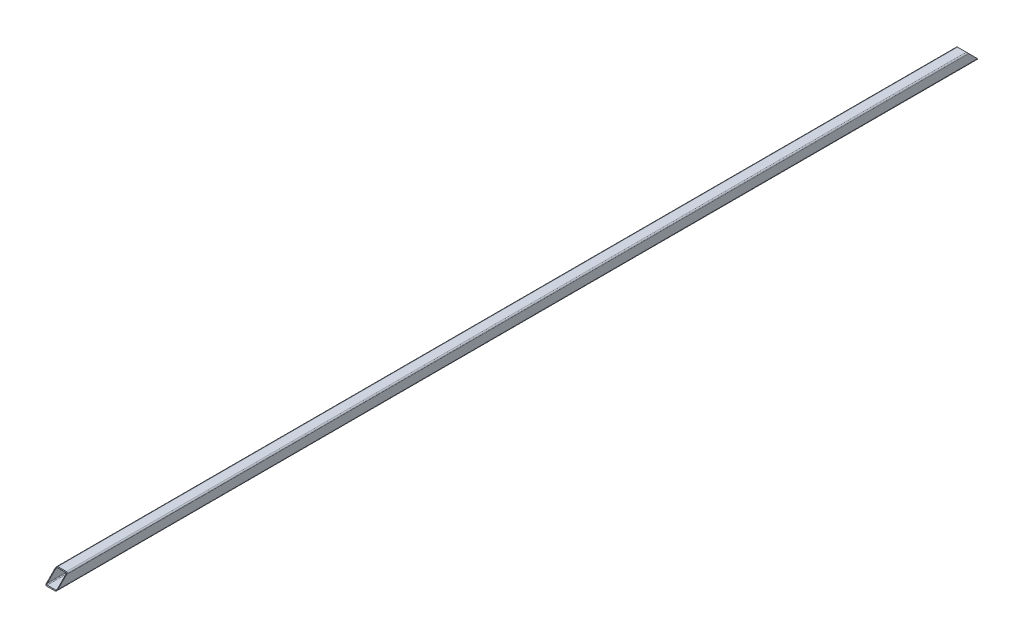
ISO-10303-21;
HEADER;
FILE_DESCRIPTION(('STEP AP214'),'2;1');
FILE_NAME('part.step','',(''),(''),'','','');
FILE_SCHEMA(('AUTOMOTIVE_DESIGN { 1 0 10303 214 1 1 1 1 }'));
ENDSEC;
DATA;
#1=APPLICATION_CONTEXT('core data for automotive mechanical design processes');
#2=APPLICATION_PROTOCOL_DEFINITION('international standard','automotive_design',2000,#1);
#3=PRODUCT_CONTEXT('',#1,'mechanical');
#4=PRODUCT('Part','Part','',(#3));
#5=PRODUCT_RELATED_PRODUCT_CATEGORY('part','',(#4));
#6=PRODUCT_DEFINITION_FORMATION('','',#4);
#7=PRODUCT_DEFINITION_CONTEXT('part definition',#1,'design');
#8=PRODUCT_DEFINITION('design','',#6,#7);
#9=PRODUCT_DEFINITION_SHAPE('','',#8);
#10=(LENGTH_UNIT() NAMED_UNIT(*) SI_UNIT(.MILLI.,.METRE.));
#11=(NAMED_UNIT(*) PLANE_ANGLE_UNIT() SI_UNIT($,.RADIAN.));
#12=(NAMED_UNIT(*) SI_UNIT($,.STERADIAN.) SOLID_ANGLE_UNIT());
#13=UNCERTAINTY_MEASURE_WITH_UNIT(LENGTH_MEASURE(1.E-05),#10,'distance_accuracy_value','');
#14=(GEOMETRIC_REPRESENTATION_CONTEXT(3) GLOBAL_UNCERTAINTY_ASSIGNED_CONTEXT((#13)) GLOBAL_UNIT_ASSIGNED_CONTEXT((#10,
#11,#12)) REPRESENTATION_CONTEXT('',''));
#15=CARTESIAN_POINT('',(0.,0.,0.));
#16=DIRECTION('',(0.,0.,1.));
#17=DIRECTION('',(1.,0.,0.));
#18=AXIS2_PLACEMENT_3D('',#15,#16,#17);
#19=CARTESIAN_POINT('',(-15.5,-15.5,-3240.));
#20=DIRECTION('',(0.,0.,1.));
#21=DIRECTION('',(1.,0.,0.));
#22=AXIS2_PLACEMENT_3D('',#19,#20,#21);
#23=CYLINDRICAL_SURFACE('',#22,4.5);
#24=CARTESIAN_POINT('',(-15.5,-15.5,15.4999999999998));
#25=DIRECTION('',(0.,0.707106781186548,0.707106781186547));
#26=DIRECTION('',(0.,-0.707106781186547,0.707106781186548));
#27=AXIS2_PLACEMENT_3D('',#24,#25,#26);
#28=ELLIPSE('',#27,6.36396103067893,4.5);
#29=CARTESIAN_POINT('',(-20.,-15.5,15.4999999999998));
#30=VERTEX_POINT('',#29);
#31=CARTESIAN_POINT('',(-15.5,-20.,19.9999999999996));
#32=VERTEX_POINT('',#31);
#33=EDGE_CURVE('E164',#30,#32,#28,.T.);
#34=ORIENTED_EDGE('',*,*,#33,.F.);
#35=DIRECTION('',(0.,0.,1.));
#36=VECTOR('',#35,1.);
#37=CARTESIAN_POINT('',(-20.,-15.5,-3240.));
#38=LINE('',#37,#36);
#39=CARTESIAN_POINT('',(-20.,-15.5,-3255.5));
#40=VERTEX_POINT('',#39);
#41=EDGE_CURVE('E53',#40,#30,#38,.T.);
#42=ORIENTED_EDGE('',*,*,#41,.F.);
#43=CARTESIAN_POINT('',(-15.5,-15.5,-3255.5));
#44=DIRECTION('',(0.,0.707106781186547,-0.707106781186548));
#45=DIRECTION('',(0.,0.707106781186548,0.707106781186547));
#46=AXIS2_PLACEMENT_3D('',#43,#44,#45);
#47=ELLIPSE('',#46,6.36396103067893,4.5);
#48=CARTESIAN_POINT('',(-15.5,-20.,-3260.));
#49=VERTEX_POINT('',#48);
#50=EDGE_CURVE('E176',#49,#40,#47,.T.);
#51=ORIENTED_EDGE('',*,*,#50,.F.);
#52=DIRECTION('',(0.,0.,1.));
#53=VECTOR('',#52,1.);
#54=CARTESIAN_POINT('',(-15.5,-20.,-3240.));
#55=LINE('',#54,#53);
#56=EDGE_CURVE('E195',#49,#32,#55,.T.);
#57=ORIENTED_EDGE('',*,*,#56,.T.);
#58=EDGE_LOOP('',(#34,#42,#51,#57));
#59=FACE_BOUND('',#58,.T.);
#60=ADVANCED_FACE('F39',(#59),#23,.T.);
#61=CARTESIAN_POINT('',(-20.,-15.5,-3240.));
#62=DIRECTION('',(1.,0.,0.));
#63=DIRECTION('',(0.,0.,-1.));
#64=AXIS2_PLACEMENT_3D('',#61,#62,#63);
#65=PLANE('',#64);
#66=DIRECTION('',(0.,-0.707106781186547,0.707106781186548));
#67=VECTOR('',#66,1.);
#68=CARTESIAN_POINT('',(-20.,1612.25,-1612.25));
#69=LINE('',#68,#67);
#70=CARTESIAN_POINT('',(-20.,15.4999999999998,-15.4999999999996));
#71=VERTEX_POINT('',#70);
#72=EDGE_CURVE('E234',#71,#30,#69,.T.);
#73=ORIENTED_EDGE('',*,*,#72,.F.);
#74=DIRECTION('',(0.,0.,1.));
#75=VECTOR('',#74,1.);
#76=CARTESIAN_POINT('',(-20.,15.5,-3240.));
#77=LINE('',#76,#75);
#78=CARTESIAN_POINT('',(-20.,15.5,-3224.5));
#79=VERTEX_POINT('',#78);
#80=EDGE_CURVE('E173',#79,#71,#77,.T.);
#81=ORIENTED_EDGE('',*,*,#80,.F.);
#82=DIRECTION('',(0.,0.707106781186548,0.707106781186547));
#83=VECTOR('',#82,1.);
#84=CARTESIAN_POINT('',(-20.,-7.75,-3247.75));
#85=LINE('',#84,#83);
#86=EDGE_CURVE('E285',#40,#79,#85,.T.);
#87=ORIENTED_EDGE('',*,*,#86,.F.);
#88=ORIENTED_EDGE('',*,*,#41,.T.);
#89=EDGE_LOOP('',(#73,#81,#87,#88));
#90=FACE_BOUND('',#89,.T.);
#91=ADVANCED_FACE('F293',(#90),#65,.F.);
#92=CARTESIAN_POINT('',(-15.5,15.5,-3240.));
#93=DIRECTION('',(0.,0.,1.));
#94=DIRECTION('',(1.,0.,0.));
#95=AXIS2_PLACEMENT_3D('',#92,#93,#94);
#96=CYLINDRICAL_SURFACE('',#95,4.5);
#97=CARTESIAN_POINT('',(-15.5,15.5,-15.4999999999994));
#98=DIRECTION('',(0.,0.707106781186548,0.707106781186547));
#99=DIRECTION('',(0.,-0.707106781186547,0.707106781186548));
#100=AXIS2_PLACEMENT_3D('',#97,#98,#99);
#101=ELLIPSE('',#100,6.36396103067893,4.5);
#102=CARTESIAN_POINT('',(-15.5,20.,-19.9999999999991));
#103=VERTEX_POINT('',#102);
#104=EDGE_CURVE('E237',#103,#71,#101,.T.);
#105=ORIENTED_EDGE('',*,*,#104,.F.);
#106=DIRECTION('',(0.,0.,1.));
#107=VECTOR('',#106,1.);
#108=CARTESIAN_POINT('',(-15.5,20.,-3240.));
#109=LINE('',#108,#107);
#110=CARTESIAN_POINT('',(-15.5,20.,-3220.));
#111=VERTEX_POINT('',#110);
#112=EDGE_CURVE('E209',#111,#103,#109,.T.);
#113=ORIENTED_EDGE('',*,*,#112,.F.);
#114=CARTESIAN_POINT('',(-15.5,15.5,-3224.5));
#115=DIRECTION('',(0.,0.707106781186547,-0.707106781186548));
#116=DIRECTION('',(0.,0.707106781186548,0.707106781186547));
#117=AXIS2_PLACEMENT_3D('',#114,#115,#116);
#118=ELLIPSE('',#117,6.36396103067893,4.5);
#119=EDGE_CURVE('E283',#79,#111,#118,.T.);
#120=ORIENTED_EDGE('',*,*,#119,.F.);
#121=ORIENTED_EDGE('',*,*,#80,.T.);
#122=EDGE_LOOP('',(#105,#113,#120,#121));
#123=FACE_BOUND('',#122,.T.);
#124=ADVANCED_FACE('F295',(#123),#96,.T.);
#125=CARTESIAN_POINT('',(-15.5,20.,-3240.));
#126=DIRECTION('',(0.,-1.,0.));
#127=DIRECTION('',(0.,0.,-1.));
#128=AXIS2_PLACEMENT_3D('',#125,#126,#127);
#129=PLANE('',#128);
#130=DIRECTION('',(-1.,0.,0.));
#131=VECTOR('',#130,1.);
#132=CARTESIAN_POINT('',(-15.5,20.,-20.));
#133=LINE('',#132,#131);
#134=CARTESIAN_POINT('',(15.5,20.,-20.));
#135=VERTEX_POINT('',#134);
#136=EDGE_CURVE('E240',#135,#103,#133,.T.);
#137=ORIENTED_EDGE('',*,*,#136,.F.);
#138=DIRECTION('',(0.,0.,1.));
#139=VECTOR('',#138,1.);
#140=CARTESIAN_POINT('',(15.5,20.,-3240.));
#141=LINE('',#140,#139);
#142=CARTESIAN_POINT('',(15.5,20.,-3220.));
#143=VERTEX_POINT('',#142);
#144=EDGE_CURVE('E206',#143,#135,#141,.T.);
#145=ORIENTED_EDGE('',*,*,#144,.F.);
#146=DIRECTION('',(1.,0.,0.));
#147=VECTOR('',#146,1.);
#148=CARTESIAN_POINT('',(-15.5,20.,-3220.));
#149=LINE('',#148,#147);
#150=EDGE_CURVE('E280',#111,#143,#149,.T.);
#151=ORIENTED_EDGE('',*,*,#150,.F.);
#152=ORIENTED_EDGE('',*,*,#112,.T.);
#153=EDGE_LOOP('',(#137,#145,#151,#152));
#154=FACE_BOUND('',#153,.T.);
#155=ADVANCED_FACE('F299',(#154),#129,.F.);
#156=CARTESIAN_POINT('',(15.5,15.5,-3240.));
#157=DIRECTION('',(0.,0.,1.));
#158=DIRECTION('',(1.,0.,0.));
#159=AXIS2_PLACEMENT_3D('',#156,#157,#158);
#160=CYLINDRICAL_SURFACE('',#159,4.5);
#161=CARTESIAN_POINT('',(15.5,15.5,-15.4999999999994));
#162=DIRECTION('',(0.,0.707106781186548,0.707106781186547));
#163=DIRECTION('',(0.,-0.707106781186547,0.707106781186548));
#164=AXIS2_PLACEMENT_3D('',#161,#162,#163);
#165=ELLIPSE('',#164,6.36396103067893,4.5);
#166=CARTESIAN_POINT('',(20.,15.5,-15.4999999999994));
#167=VERTEX_POINT('',#166);
#168=EDGE_CURVE('E243',#167,#135,#165,.T.);
#169=ORIENTED_EDGE('',*,*,#168,.F.);
#170=DIRECTION('',(0.,0.,1.));
#171=VECTOR('',#170,1.);
#172=CARTESIAN_POINT('',(20.,15.5,-3240.));
#173=LINE('',#172,#171);
#174=CARTESIAN_POINT('',(20.,15.5,-3224.5));
#175=VERTEX_POINT('',#174);
#176=EDGE_CURVE('E203',#175,#167,#173,.T.);
#177=ORIENTED_EDGE('',*,*,#176,.F.);
#178=CARTESIAN_POINT('',(15.5,15.5,-3224.5));
#179=DIRECTION('',(0.,0.707106781186547,-0.707106781186548));
#180=DIRECTION('',(0.,0.707106781186548,0.707106781186547));
#181=AXIS2_PLACEMENT_3D('',#178,#179,#180);
#182=ELLIPSE('',#181,6.36396103067893,4.5);
#183=EDGE_CURVE('E277',#143,#175,#182,.T.);
#184=ORIENTED_EDGE('',*,*,#183,.F.);
#185=ORIENTED_EDGE('',*,*,#144,.T.);
#186=EDGE_LOOP('',(#169,#177,#184,#185));
#187=FACE_BOUND('',#186,.T.);
#188=ADVANCED_FACE('F301',(#187),#160,.T.);
#189=CARTESIAN_POINT('',(20.,-15.5,-3240.));
#190=DIRECTION('',(-1.,0.,0.));
#191=DIRECTION('',(0.,0.,1.));
#192=AXIS2_PLACEMENT_3D('',#189,#190,#191);
#193=PLANE('',#192);
#194=DIRECTION('',(0.,0.707106781186547,-0.707106781186548));
#195=VECTOR('',#194,1.);
#196=CARTESIAN_POINT('',(20.,1612.25,-1612.25));
#197=LINE('',#196,#195);
#198=CARTESIAN_POINT('',(20.,-15.4999999999999,15.5000000000001));
#199=VERTEX_POINT('',#198);
#200=EDGE_CURVE('E246',#199,#167,#197,.T.);
#201=ORIENTED_EDGE('',*,*,#200,.F.);
#202=DIRECTION('',(0.,0.,1.));
#203=VECTOR('',#202,1.);
#204=CARTESIAN_POINT('',(20.,-15.5,-3240.));
#205=LINE('',#204,#203);
#206=CARTESIAN_POINT('',(20.,-15.5,-3255.5));
#207=VERTEX_POINT('',#206);
#208=EDGE_CURVE('E200',#207,#199,#205,.T.);
#209=ORIENTED_EDGE('',*,*,#208,.F.);
#210=DIRECTION('',(0.,-0.707106781186548,-0.707106781186547));
#211=VECTOR('',#210,1.);
#212=CARTESIAN_POINT('',(20.,-7.75,-3247.75));
#213=LINE('',#212,#211);
#214=EDGE_CURVE('E274',#175,#207,#213,.T.);
#215=ORIENTED_EDGE('',*,*,#214,.F.);
#216=ORIENTED_EDGE('',*,*,#176,.T.);
#217=EDGE_LOOP('',(#201,#209,#215,#216));
#218=FACE_BOUND('',#217,.T.);
#219=ADVANCED_FACE('F305',(#218),#193,.F.);
#220=CARTESIAN_POINT('',(15.5,-15.5,-3240.));
#221=DIRECTION('',(0.,0.,1.));
#222=DIRECTION('',(1.,0.,0.));
#223=AXIS2_PLACEMENT_3D('',#220,#221,#222);
#224=CYLINDRICAL_SURFACE('',#223,4.5);
#225=CARTESIAN_POINT('',(15.5,-15.5,15.4999999999998));
#226=DIRECTION('',(0.,0.707106781186548,0.707106781186547));
#227=DIRECTION('',(0.,-0.707106781186547,0.707106781186548));
#228=AXIS2_PLACEMENT_3D('',#225,#226,#227);
#229=ELLIPSE('',#228,6.36396103067893,4.5);
#230=CARTESIAN_POINT('',(15.5,-20.,19.9999999999996));
#231=VERTEX_POINT('',#230);
#232=EDGE_CURVE('E249',#231,#199,#229,.T.);
#233=ORIENTED_EDGE('',*,*,#232,.F.);
#234=DIRECTION('',(0.,0.,1.));
#235=VECTOR('',#234,1.);
#236=CARTESIAN_POINT('',(15.5,-20.,-3240.));
#237=LINE('',#236,#235);
#238=CARTESIAN_POINT('',(15.5,-20.,-3260.));
#239=VERTEX_POINT('',#238);
#240=EDGE_CURVE('E197',#239,#231,#237,.T.);
#241=ORIENTED_EDGE('',*,*,#240,.F.);
#242=CARTESIAN_POINT('',(15.5,-15.5,-3255.5));
#243=DIRECTION('',(0.,0.707106781186547,-0.707106781186548));
#244=DIRECTION('',(0.,0.707106781186548,0.707106781186547));
#245=AXIS2_PLACEMENT_3D('',#242,#243,#244);
#246=ELLIPSE('',#245,6.36396103067893,4.5);
#247=EDGE_CURVE('E271',#207,#239,#246,.T.);
#248=ORIENTED_EDGE('',*,*,#247,.F.);
#249=ORIENTED_EDGE('',*,*,#208,.T.);
#250=EDGE_LOOP('',(#233,#241,#248,#249));
#251=FACE_BOUND('',#250,.T.);
#252=ADVANCED_FACE('F307',(#251),#224,.T.);
#253=CARTESIAN_POINT('',(-15.5,-20.,-3240.));
#254=DIRECTION('',(0.,1.,0.));
#255=DIRECTION('',(0.,0.,1.));
#256=AXIS2_PLACEMENT_3D('',#253,#254,#255);
#257=PLANE('',#256);
#258=DIRECTION('',(1.,0.,0.));
#259=VECTOR('',#258,1.);
#260=CARTESIAN_POINT('',(-15.5,-20.,20.0000000000005));
#261=LINE('',#260,#259);
#262=EDGE_CURVE('E222',#32,#231,#261,.T.);
#263=ORIENTED_EDGE('',*,*,#262,.F.);
#264=ORIENTED_EDGE('',*,*,#56,.F.);
#265=DIRECTION('',(-1.,0.,0.));
#266=VECTOR('',#265,1.);
#267=CARTESIAN_POINT('',(-15.5,-20.,-3260.));
#268=LINE('',#267,#266);
#269=EDGE_CURVE('E268',#239,#49,#268,.T.);
#270=ORIENTED_EDGE('',*,*,#269,.F.);
#271=ORIENTED_EDGE('',*,*,#240,.T.);
#272=EDGE_LOOP('',(#263,#264,#270,#271));
#273=FACE_BOUND('',#272,.T.);
#274=ADVANCED_FACE('F309',(#273),#257,.F.);
#275=CARTESIAN_POINT('',(0.,0.,-3240.));
#276=DIRECTION('',(0.,0.707106781186547,-0.707106781186548));
#277=DIRECTION('',(0.,0.707106781186548,0.707106781186547));
#278=AXIS2_PLACEMENT_3D('',#275,#276,#277);
#279=PLANE('',#278);
#280=CARTESIAN_POINT('',(-15.,-15.,-3255.));
#281=DIRECTION('',(0.,0.707106781186547,-0.707106781186548));
#282=DIRECTION('',(0.,0.707106781186548,0.707106781186547));
#283=AXIS2_PLACEMENT_3D('',#280,#281,#282);
#284=ELLIPSE('',#283,4.24264068711928,3.);
#285=CARTESIAN_POINT('',(-15.,-18.,-3258.));
#286=VERTEX_POINT('',#285);
#287=CARTESIAN_POINT('',(-18.,-15.,-3255.));
#288=VERTEX_POINT('',#287);
#289=EDGE_CURVE('E169',#286,#288,#284,.T.);
#290=ORIENTED_EDGE('',*,*,#289,.F.);
#291=DIRECTION('',(-1.,0.,0.));
#292=VECTOR('',#291,1.);
#293=CARTESIAN_POINT('',(-15.,-18.,-3258.));
#294=LINE('',#293,#292);
#295=CARTESIAN_POINT('',(15.,-18.,-3258.));
#296=VERTEX_POINT('',#295);
#297=EDGE_CURVE('E264',#296,#286,#294,.T.);
#298=ORIENTED_EDGE('',*,*,#297,.F.);
#299=CARTESIAN_POINT('',(15.,-15.,-3255.));
#300=DIRECTION('',(0.,0.707106781186547,-0.707106781186548));
#301=DIRECTION('',(0.,0.707106781186548,0.707106781186547));
#302=AXIS2_PLACEMENT_3D('',#299,#300,#301);
#303=ELLIPSE('',#302,4.24264068711928,3.);
#304=CARTESIAN_POINT('',(18.,-15.,-3255.));
#305=VERTEX_POINT('',#304);
#306=EDGE_CURVE('E261',#305,#296,#303,.T.);
#307=ORIENTED_EDGE('',*,*,#306,.F.);
#308=DIRECTION('',(0.,-0.707106781186548,-0.707106781186547));
#309=VECTOR('',#308,1.);
#310=CARTESIAN_POINT('',(18.,-7.5,-3247.5));
#311=LINE('',#310,#309);
#312=CARTESIAN_POINT('',(18.,15.,-3225.));
#313=VERTEX_POINT('',#312);
#314=EDGE_CURVE('E258',#313,#305,#311,.T.);
#315=ORIENTED_EDGE('',*,*,#314,.F.);
#316=CARTESIAN_POINT('',(15.,15.,-3225.));
#317=DIRECTION('',(0.,0.707106781186547,-0.707106781186548));
#318=DIRECTION('',(0.,0.707106781186548,0.707106781186547));
#319=AXIS2_PLACEMENT_3D('',#316,#317,#318);
#320=ELLIPSE('',#319,4.24264068711928,3.);
#321=CARTESIAN_POINT('',(15.,18.,-3222.));
#322=VERTEX_POINT('',#321);
#323=EDGE_CURVE('E255',#322,#313,#320,.T.);
#324=ORIENTED_EDGE('',*,*,#323,.F.);
#325=DIRECTION('',(1.,0.,0.));
#326=VECTOR('',#325,1.);
#327=CARTESIAN_POINT('',(-15.,18.,-3222.));
#328=LINE('',#327,#326);
#329=CARTESIAN_POINT('',(-15.,18.,-3222.));
#330=VERTEX_POINT('',#329);
#331=EDGE_CURVE('E219',#330,#322,#328,.T.);
#332=ORIENTED_EDGE('',*,*,#331,.F.);
#333=CARTESIAN_POINT('',(-15.,15.,-3225.));
#334=DIRECTION('',(0.,0.707106781186547,-0.707106781186548));
#335=DIRECTION('',(0.,0.707106781186548,0.707106781186547));
#336=AXIS2_PLACEMENT_3D('',#333,#334,#335);
#337=ELLIPSE('',#336,4.24264068711928,3.);
#338=CARTESIAN_POINT('',(-18.,15.,-3225.));
#339=VERTEX_POINT('',#338);
#340=EDGE_CURVE('E217',#339,#330,#337,.T.);
#341=ORIENTED_EDGE('',*,*,#340,.F.);
#342=DIRECTION('',(0.,0.707106781186548,0.707106781186547));
#343=VECTOR('',#342,1.);
#344=CARTESIAN_POINT('',(-18.,-7.5,-3247.5));
#345=LINE('',#344,#343);
#346=EDGE_CURVE('E46',#288,#339,#345,.T.);
#347=ORIENTED_EDGE('',*,*,#346,.F.);
#348=EDGE_LOOP('',(#290,#298,#307,#315,#324,#332,#341,#347));
#349=FACE_BOUND('',#348,.T.);
#350=ORIENTED_EDGE('',*,*,#269,.T.);
#351=ORIENTED_EDGE('',*,*,#50,.T.);
#352=ORIENTED_EDGE('',*,*,#86,.T.);
#353=ORIENTED_EDGE('',*,*,#119,.T.);
#354=ORIENTED_EDGE('',*,*,#150,.T.);
#355=ORIENTED_EDGE('',*,*,#183,.T.);
#356=ORIENTED_EDGE('',*,*,#214,.T.);
#357=ORIENTED_EDGE('',*,*,#247,.T.);
#358=EDGE_LOOP('',(#350,#351,#352,#353,#354,#355,#356,#357));
#359=FACE_BOUND('',#358,.T.);
#360=ADVANCED_FACE('F214',(#349,#359),#279,.T.);
#361=CARTESIAN_POINT('',(-15.,-15.,-3240.));
#362=DIRECTION('',(0.,0.,1.));
#363=DIRECTION('',(1.,0.,0.));
#364=AXIS2_PLACEMENT_3D('',#361,#362,#363);
#365=CYLINDRICAL_SURFACE('',#364,3.);
#366=DIRECTION('',(0.,0.,1.));
#367=VECTOR('',#366,1.);
#368=CARTESIAN_POINT('',(-18.,-15.,-3240.));
#369=LINE('',#368,#367);
#370=CARTESIAN_POINT('',(-18.,-15.,15.0000000000006));
#371=VERTEX_POINT('',#370);
#372=EDGE_CURVE('E160',#288,#371,#369,.T.);
#373=ORIENTED_EDGE('',*,*,#372,.T.);
#374=CARTESIAN_POINT('',(-15.,-15.,15.0000000000006));
#375=DIRECTION('',(0.,0.707106781186548,0.707106781186547));
#376=DIRECTION('',(0.,-0.707106781186547,0.707106781186548));
#377=AXIS2_PLACEMENT_3D('',#374,#375,#376);
#378=ELLIPSE('',#377,4.24264068711928,3.);
#379=CARTESIAN_POINT('',(-15.,-18.,18.0000000000002));
#380=VERTEX_POINT('',#379);
#381=EDGE_CURVE('E11',#371,#380,#378,.T.);
#382=ORIENTED_EDGE('',*,*,#381,.T.);
#383=DIRECTION('',(0.,0.,1.));
#384=VECTOR('',#383,1.);
#385=CARTESIAN_POINT('',(-15.,-18.,-3240.));
#386=LINE('',#385,#384);
#387=EDGE_CURVE('E193',#286,#380,#386,.T.);
#388=ORIENTED_EDGE('',*,*,#387,.F.);
#389=ORIENTED_EDGE('',*,*,#289,.T.);
#390=EDGE_LOOP('',(#373,#382,#388,#389));
#391=FACE_BOUND('',#390,.T.);
#392=ADVANCED_FACE('F168',(#391),#365,.F.);
#393=CARTESIAN_POINT('',(-15.,-18.,-3240.));
#394=DIRECTION('',(0.,1.,0.));
#395=DIRECTION('',(0.,0.,1.));
#396=AXIS2_PLACEMENT_3D('',#393,#394,#395);
#397=PLANE('',#396);
#398=ORIENTED_EDGE('',*,*,#387,.T.);
#399=DIRECTION('',(1.,0.,0.));
#400=VECTOR('',#399,1.);
#401=CARTESIAN_POINT('',(-15.,-18.,18.0000000000002));
#402=LINE('',#401,#400);
#403=CARTESIAN_POINT('',(15.,-18.,18.0000000000002));
#404=VERTEX_POINT('',#403);
#405=EDGE_CURVE('E61',#380,#404,#402,.T.);
#406=ORIENTED_EDGE('',*,*,#405,.T.);
#407=DIRECTION('',(0.,0.,1.));
#408=VECTOR('',#407,1.);
#409=CARTESIAN_POINT('',(15.,-18.,-3240.));
#410=LINE('',#409,#408);
#411=EDGE_CURVE('E190',#296,#404,#410,.T.);
#412=ORIENTED_EDGE('',*,*,#411,.F.);
#413=ORIENTED_EDGE('',*,*,#297,.T.);
#414=EDGE_LOOP('',(#398,#406,#412,#413));
#415=FACE_BOUND('',#414,.T.);
#416=ADVANCED_FACE('F380',(#415),#397,.T.);
#417=CARTESIAN_POINT('',(15.,-15.,-3240.));
#418=DIRECTION('',(0.,0.,1.));
#419=DIRECTION('',(1.,0.,0.));
#420=AXIS2_PLACEMENT_3D('',#417,#418,#419);
#421=CYLINDRICAL_SURFACE('',#420,3.);
#422=ORIENTED_EDGE('',*,*,#411,.T.);
#423=CARTESIAN_POINT('',(15.,-15.,15.0000000000006));
#424=DIRECTION('',(0.,0.707106781186548,0.707106781186547));
#425=DIRECTION('',(0.,-0.707106781186547,0.707106781186548));
#426=AXIS2_PLACEMENT_3D('',#423,#424,#425);
#427=ELLIPSE('',#426,4.24264068711928,3.);
#428=CARTESIAN_POINT('',(18.,-15.,15.0000000000006));
#429=VERTEX_POINT('',#428);
#430=EDGE_CURVE('E463',#404,#429,#427,.T.);
#431=ORIENTED_EDGE('',*,*,#430,.T.);
#432=DIRECTION('',(0.,0.,1.));
#433=VECTOR('',#432,1.);
#434=CARTESIAN_POINT('',(18.,-15.,-3240.));
#435=LINE('',#434,#433);
#436=EDGE_CURVE('E187',#305,#429,#435,.T.);
#437=ORIENTED_EDGE('',*,*,#436,.F.);
#438=ORIENTED_EDGE('',*,*,#306,.T.);
#439=EDGE_LOOP('',(#422,#431,#437,#438));
#440=FACE_BOUND('',#439,.T.);
#441=ADVANCED_FACE('F386',(#440),#421,.F.);
#442=CARTESIAN_POINT('',(18.,-15.,-3240.));
#443=DIRECTION('',(-1.,0.,0.));
#444=DIRECTION('',(0.,0.,1.));
#445=AXIS2_PLACEMENT_3D('',#442,#443,#444);
#446=PLANE('',#445);
#447=ORIENTED_EDGE('',*,*,#436,.T.);
#448=DIRECTION('',(0.,0.707106781186547,-0.707106781186548));
#449=VECTOR('',#448,1.);
#450=CARTESIAN_POINT('',(18.,1612.5,-1612.5));
#451=LINE('',#450,#449);
#452=CARTESIAN_POINT('',(18.,14.9999999999999,-14.999999999999));
#453=VERTEX_POINT('',#452);
#454=EDGE_CURVE('E462',#429,#453,#451,.T.);
#455=ORIENTED_EDGE('',*,*,#454,.T.);
#456=DIRECTION('',(0.,0.,1.));
#457=VECTOR('',#456,1.);
#458=CARTESIAN_POINT('',(18.,15.,-3240.));
#459=LINE('',#458,#457);
#460=EDGE_CURVE('E184',#313,#453,#459,.T.);
#461=ORIENTED_EDGE('',*,*,#460,.F.);
#462=ORIENTED_EDGE('',*,*,#314,.T.);
#463=EDGE_LOOP('',(#447,#455,#461,#462));
#464=FACE_BOUND('',#463,.T.);
#465=ADVANCED_FACE('F394',(#464),#446,.T.);
#466=CARTESIAN_POINT('',(15.,15.,-3240.));
#467=DIRECTION('',(0.,0.,1.));
#468=DIRECTION('',(1.,0.,0.));
#469=AXIS2_PLACEMENT_3D('',#466,#467,#468);
#470=CYLINDRICAL_SURFACE('',#469,3.);
#471=ORIENTED_EDGE('',*,*,#460,.T.);
#472=CARTESIAN_POINT('',(15.,15.,-15.0000000000001));
#473=DIRECTION('',(0.,0.707106781186548,0.707106781186547));
#474=DIRECTION('',(0.,-0.707106781186547,0.707106781186548));
#475=AXIS2_PLACEMENT_3D('',#472,#473,#474);
#476=ELLIPSE('',#475,4.24264068711928,3.);
#477=CARTESIAN_POINT('',(15.,18.,-17.9999999999998));
#478=VERTEX_POINT('',#477);
#479=EDGE_CURVE('E228',#453,#478,#476,.T.);
#480=ORIENTED_EDGE('',*,*,#479,.T.);
#481=DIRECTION('',(0.,0.,1.));
#482=VECTOR('',#481,1.);
#483=CARTESIAN_POINT('',(15.,18.,-3240.));
#484=LINE('',#483,#482);
#485=EDGE_CURVE('E181',#322,#478,#484,.T.);
#486=ORIENTED_EDGE('',*,*,#485,.F.);
#487=ORIENTED_EDGE('',*,*,#323,.T.);
#488=EDGE_LOOP('',(#471,#480,#486,#487));
#489=FACE_BOUND('',#488,.T.);
#490=ADVANCED_FACE('F402',(#489),#470,.F.);
#491=CARTESIAN_POINT('',(-15.,18.,-3240.));
#492=DIRECTION('',(0.,-1.,0.));
#493=DIRECTION('',(0.,0.,-1.));
#494=AXIS2_PLACEMENT_3D('',#491,#492,#493);
#495=PLANE('',#494);
#496=ORIENTED_EDGE('',*,*,#485,.T.);
#497=DIRECTION('',(-1.,0.,0.));
#498=VECTOR('',#497,1.);
#499=CARTESIAN_POINT('',(-15.,18.,-17.9999999999998));
#500=LINE('',#499,#498);
#501=CARTESIAN_POINT('',(-15.,18.,-17.9999999999998));
#502=VERTEX_POINT('',#501);
#503=EDGE_CURVE('E226',#478,#502,#500,.T.);
#504=ORIENTED_EDGE('',*,*,#503,.T.);
#505=DIRECTION('',(0.,0.,1.));
#506=VECTOR('',#505,1.);
#507=CARTESIAN_POINT('',(-15.,18.,-3240.));
#508=LINE('',#507,#506);
#509=EDGE_CURVE('E171',#330,#502,#508,.T.);
#510=ORIENTED_EDGE('',*,*,#509,.F.);
#511=ORIENTED_EDGE('',*,*,#331,.T.);
#512=EDGE_LOOP('',(#496,#504,#510,#511));
#513=FACE_BOUND('',#512,.T.);
#514=ADVANCED_FACE('F410',(#513),#495,.T.);
#515=CARTESIAN_POINT('',(-15.,15.,-3240.));
#516=DIRECTION('',(0.,0.,1.));
#517=DIRECTION('',(1.,0.,0.));
#518=AXIS2_PLACEMENT_3D('',#515,#516,#517);
#519=CYLINDRICAL_SURFACE('',#518,3.);
#520=ORIENTED_EDGE('',*,*,#509,.T.);
#521=CARTESIAN_POINT('',(-15.,15.,-15.0000000000001));
#522=DIRECTION('',(0.,0.707106781186548,0.707106781186547));
#523=DIRECTION('',(0.,-0.707106781186547,0.707106781186548));
#524=AXIS2_PLACEMENT_3D('',#521,#522,#523);
#525=ELLIPSE('',#524,4.24264068711928,3.);
#526=CARTESIAN_POINT('',(-18.,15.,-15.0000000000001));
#527=VERTEX_POINT('',#526);
#528=EDGE_CURVE('E165',#502,#527,#525,.T.);
#529=ORIENTED_EDGE('',*,*,#528,.T.);
#530=DIRECTION('',(0.,0.,1.));
#531=VECTOR('',#530,1.);
#532=CARTESIAN_POINT('',(-18.,15.,-3240.));
#533=LINE('',#532,#531);
#534=EDGE_CURVE('E162',#339,#527,#533,.T.);
#535=ORIENTED_EDGE('',*,*,#534,.F.);
#536=ORIENTED_EDGE('',*,*,#340,.T.);
#537=EDGE_LOOP('',(#520,#529,#535,#536));
#538=FACE_BOUND('',#537,.T.);
#539=ADVANCED_FACE('F224',(#538),#519,.F.);
#540=CARTESIAN_POINT('',(-18.,-15.,-3240.));
#541=DIRECTION('',(1.,0.,0.));
#542=DIRECTION('',(0.,0.,-1.));
#543=AXIS2_PLACEMENT_3D('',#540,#541,#542);
#544=PLANE('',#543);
#545=ORIENTED_EDGE('',*,*,#534,.T.);
#546=DIRECTION('',(0.,-0.707106781186547,0.707106781186548));
#547=VECTOR('',#546,1.);
#548=CARTESIAN_POINT('',(-18.,1612.5,-1612.5));
#549=LINE('',#548,#547);
#550=EDGE_CURVE('E151',#527,#371,#549,.T.);
#551=ORIENTED_EDGE('',*,*,#550,.T.);
#552=ORIENTED_EDGE('',*,*,#372,.F.);
#553=ORIENTED_EDGE('',*,*,#346,.T.);
#554=EDGE_LOOP('',(#545,#551,#552,#553));
#555=FACE_BOUND('',#554,.T.);
#556=ADVANCED_FACE('F158',(#555),#544,.T.);
#557=CARTESIAN_POINT('',(0.,0.,0.));
#558=DIRECTION('',(0.,0.707106781186548,0.707106781186547));
#559=DIRECTION('',(0.,-0.707106781186547,0.707106781186548));
#560=AXIS2_PLACEMENT_3D('',#557,#558,#559);
#561=PLANE('',#560);
#562=ORIENTED_EDGE('',*,*,#550,.F.);
#563=ORIENTED_EDGE('',*,*,#528,.F.);
#564=ORIENTED_EDGE('',*,*,#503,.F.);
#565=ORIENTED_EDGE('',*,*,#479,.F.);
#566=ORIENTED_EDGE('',*,*,#454,.F.);
#567=ORIENTED_EDGE('',*,*,#430,.F.);
#568=ORIENTED_EDGE('',*,*,#405,.F.);
#569=ORIENTED_EDGE('',*,*,#381,.F.);
#570=EDGE_LOOP('',(#562,#563,#564,#565,#566,#567,#568,#569));
#571=FACE_BOUND('',#570,.T.);
#572=ORIENTED_EDGE('',*,*,#33,.T.);
#573=ORIENTED_EDGE('',*,*,#262,.T.);
#574=ORIENTED_EDGE('',*,*,#232,.T.);
#575=ORIENTED_EDGE('',*,*,#200,.T.);
#576=ORIENTED_EDGE('',*,*,#168,.T.);
#577=ORIENTED_EDGE('',*,*,#136,.T.);
#578=ORIENTED_EDGE('',*,*,#104,.T.);
#579=ORIENTED_EDGE('',*,*,#72,.T.);
#580=EDGE_LOOP('',(#572,#573,#574,#575,#576,#577,#578,#579));
#581=FACE_BOUND('',#580,.T.);
#582=ADVANCED_FACE('F149',(#571,#581),#561,.T.);
#583=CLOSED_SHELL('',(#60,#91,#124,#155,#188,#219,#252,#274,#360,#392,#416,#441,#465,#490,#514,
#539,#556,#582));
#584=MANIFOLD_SOLID_BREP('B2',#583);
#585=ADVANCED_BREP_SHAPE_REPRESENTATION('',(#18,#584),#14);
#586=SHAPE_DEFINITION_REPRESENTATION(#9,#585);
ENDSEC;
END-ISO-10303-21;
